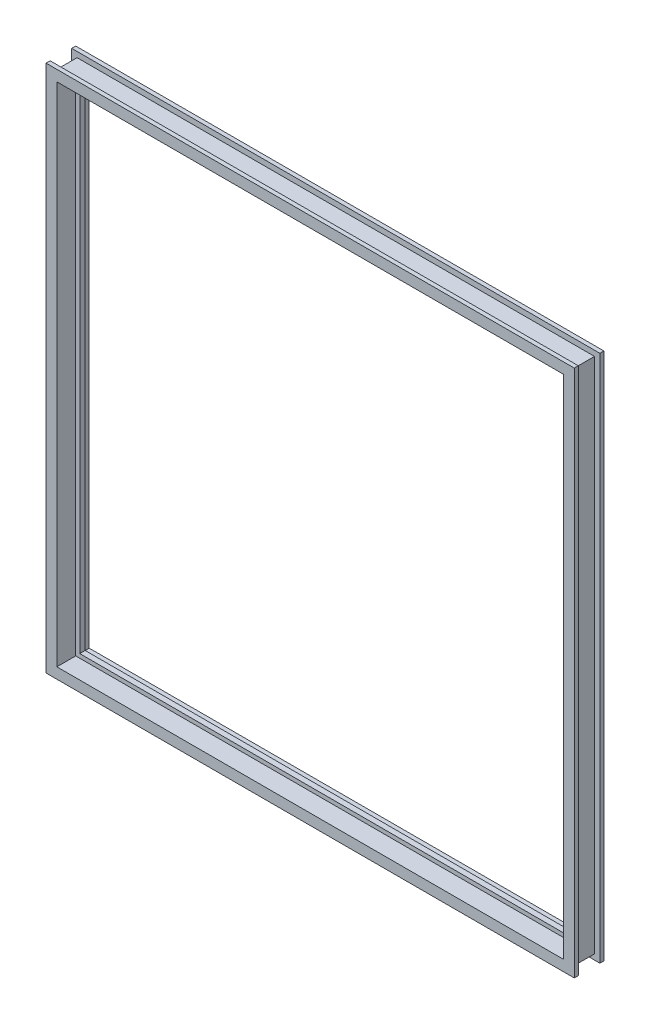
ISO-10303-21;
HEADER;
FILE_DESCRIPTION(('STEP AP214'),'2;1');
FILE_NAME('part.step','',(''),(''),'','','');
FILE_SCHEMA(('AUTOMOTIVE_DESIGN { 1 0 10303 214 1 1 1 1 }'));
ENDSEC;
DATA;
#1=APPLICATION_CONTEXT('core data for automotive mechanical design processes');
#2=APPLICATION_PROTOCOL_DEFINITION('international standard','automotive_design',2000,#1);
#3=PRODUCT_CONTEXT('',#1,'mechanical');
#4=PRODUCT('Part','Part','',(#3));
#5=PRODUCT_RELATED_PRODUCT_CATEGORY('part','',(#4));
#6=PRODUCT_DEFINITION_FORMATION('','',#4);
#7=PRODUCT_DEFINITION_CONTEXT('part definition',#1,'design');
#8=PRODUCT_DEFINITION('design','',#6,#7);
#9=PRODUCT_DEFINITION_SHAPE('','',#8);
#10=(LENGTH_UNIT() NAMED_UNIT(*) SI_UNIT(.MILLI.,.METRE.));
#11=(NAMED_UNIT(*) PLANE_ANGLE_UNIT() SI_UNIT($,.RADIAN.));
#12=(NAMED_UNIT(*) SI_UNIT($,.STERADIAN.) SOLID_ANGLE_UNIT());
#13=UNCERTAINTY_MEASURE_WITH_UNIT(LENGTH_MEASURE(1.E-05),#10,'distance_accuracy_value','');
#14=(GEOMETRIC_REPRESENTATION_CONTEXT(3) GLOBAL_UNCERTAINTY_ASSIGNED_CONTEXT((#13)) GLOBAL_UNIT_ASSIGNED_CONTEXT((#10,
#11,#12)) REPRESENTATION_CONTEXT('',''));
#15=CARTESIAN_POINT('',(0.,0.,0.));
#16=DIRECTION('',(0.,0.,1.));
#17=DIRECTION('',(1.,0.,0.));
#18=AXIS2_PLACEMENT_3D('',#15,#16,#17);
#19=CARTESIAN_POINT('',(304.8,616.685,-12.7));
#20=DIRECTION('',(-1.,0.,0.));
#21=DIRECTION('',(0.,-1.,0.));
#22=AXIS2_PLACEMENT_3D('',#19,#20,#21);
#23=PLANE('',#22);
#24=DIRECTION('',(0.,-1.,0.));
#25=VECTOR('',#24,1.);
#26=CARTESIAN_POINT('',(304.8,616.685,-12.7));
#27=LINE('',#26,#25);
#28=CARTESIAN_POINT('',(304.8,609.6,-12.7));
#29=VERTEX_POINT('',#28);
#30=CARTESIAN_POINT('',(304.8,0.,-12.7));
#31=VERTEX_POINT('',#30);
#32=EDGE_CURVE('E39',#29,#31,#27,.T.);
#33=ORIENTED_EDGE('',*,*,#32,.F.);
#34=DIRECTION('',(0.,0.,1.));
#35=VECTOR('',#34,1.);
#36=CARTESIAN_POINT('',(304.8,609.6,-12.7000000000002));
#37=LINE('',#36,#35);
#38=CARTESIAN_POINT('',(304.8,609.6,12.7));
#39=VERTEX_POINT('',#38);
#40=EDGE_CURVE('E326',#29,#39,#37,.T.);
#41=ORIENTED_EDGE('',*,*,#40,.T.);
#42=DIRECTION('',(0.,-1.,0.));
#43=VECTOR('',#42,1.);
#44=CARTESIAN_POINT('',(304.8,616.685,12.7));
#45=LINE('',#44,#43);
#46=CARTESIAN_POINT('',(304.8,0.,12.7));
#47=VERTEX_POINT('',#46);
#48=EDGE_CURVE('E151',#39,#47,#45,.T.);
#49=ORIENTED_EDGE('',*,*,#48,.T.);
#50=DIRECTION('',(0.,0.,1.));
#51=VECTOR('',#50,1.);
#52=CARTESIAN_POINT('',(304.8,0.,-12.7));
#53=LINE('',#52,#51);
#54=EDGE_CURVE('E148',#31,#47,#53,.T.);
#55=ORIENTED_EDGE('',*,*,#54,.F.);
#56=EDGE_LOOP('',(#33,#41,#49,#55));
#57=FACE_BOUND('',#56,.T.);
#58=ADVANCED_FACE('F36',(#57),#23,.F.);
#59=CARTESIAN_POINT('',(311.15,616.685,12.7));
#60=DIRECTION('',(-1.,0.,0.));
#61=DIRECTION('',(0.,-1.,0.));
#62=AXIS2_PLACEMENT_3D('',#59,#60,#61);
#63=PLANE('',#62);
#64=DIRECTION('',(0.,-1.,0.));
#65=VECTOR('',#64,1.);
#66=CARTESIAN_POINT('',(311.15,616.685,12.7));
#67=LINE('',#66,#65);
#68=CARTESIAN_POINT('',(311.15,615.95,12.7));
#69=VERTEX_POINT('',#68);
#70=CARTESIAN_POINT('',(311.15,-6.34999999999997,12.7));
#71=VERTEX_POINT('',#70);
#72=EDGE_CURVE('E173',#69,#71,#67,.T.);
#73=ORIENTED_EDGE('',*,*,#72,.F.);
#74=DIRECTION('',(0.,0.,1.));
#75=VECTOR('',#74,1.);
#76=CARTESIAN_POINT('',(311.15,615.95,12.7));
#77=LINE('',#76,#75);
#78=CARTESIAN_POINT('',(311.15,615.95,17.4625));
#79=VERTEX_POINT('',#78);
#80=EDGE_CURVE('E323',#69,#79,#77,.T.);
#81=ORIENTED_EDGE('',*,*,#80,.T.);
#82=DIRECTION('',(0.,-1.,0.));
#83=VECTOR('',#82,1.);
#84=CARTESIAN_POINT('',(311.15,616.685,17.4625));
#85=LINE('',#84,#83);
#86=CARTESIAN_POINT('',(311.15,-6.34999999999994,17.4625));
#87=VERTEX_POINT('',#86);
#88=EDGE_CURVE('E175',#79,#87,#85,.T.);
#89=ORIENTED_EDGE('',*,*,#88,.T.);
#90=DIRECTION('',(0.,0.,1.));
#91=VECTOR('',#90,1.);
#92=CARTESIAN_POINT('',(311.15,-6.34999999999996,12.7));
#93=LINE('',#92,#91);
#94=EDGE_CURVE('E155',#71,#87,#93,.T.);
#95=ORIENTED_EDGE('',*,*,#94,.F.);
#96=EDGE_LOOP('',(#73,#81,#89,#95));
#97=FACE_BOUND('',#96,.T.);
#98=ADVANCED_FACE('F452',(#97),#63,.F.);
#99=CARTESIAN_POINT('',(298.45,616.685,17.4625));
#100=DIRECTION('',(1.,0.,0.));
#101=DIRECTION('',(0.,1.,0.));
#102=AXIS2_PLACEMENT_3D('',#99,#100,#101);
#103=PLANE('',#102);
#104=DIRECTION('',(0.,-1.,0.));
#105=VECTOR('',#104,1.);
#106=CARTESIAN_POINT('',(298.45,616.685,17.4625));
#107=LINE('',#106,#105);
#108=CARTESIAN_POINT('',(298.45,603.25,17.4625));
#109=VERTEX_POINT('',#108);
#110=CARTESIAN_POINT('',(298.45,6.35000000000006,17.4625));
#111=VERTEX_POINT('',#110);
#112=EDGE_CURVE('E178',#109,#111,#107,.T.);
#113=ORIENTED_EDGE('',*,*,#112,.F.);
#114=DIRECTION('',(0.,0.,-1.));
#115=VECTOR('',#114,1.);
#116=CARTESIAN_POINT('',(298.45,603.25,17.4625));
#117=LINE('',#116,#115);
#118=CARTESIAN_POINT('',(298.45,603.25,-4.7625));
#119=VERTEX_POINT('',#118);
#120=EDGE_CURVE('E320',#109,#119,#117,.T.);
#121=ORIENTED_EDGE('',*,*,#120,.T.);
#122=DIRECTION('',(0.,-1.,0.));
#123=VECTOR('',#122,1.);
#124=CARTESIAN_POINT('',(298.45,616.685,-4.7625));
#125=LINE('',#124,#123);
#126=CARTESIAN_POINT('',(298.45,6.35000000000009,-4.7625));
#127=VERTEX_POINT('',#126);
#128=EDGE_CURVE('E180',#119,#127,#125,.T.);
#129=ORIENTED_EDGE('',*,*,#128,.T.);
#130=DIRECTION('',(0.,0.,-1.));
#131=VECTOR('',#130,1.);
#132=CARTESIAN_POINT('',(298.45,6.35000000000003,17.4625));
#133=LINE('',#132,#131);
#134=EDGE_CURVE('E361',#111,#127,#133,.T.);
#135=ORIENTED_EDGE('',*,*,#134,.F.);
#136=EDGE_LOOP('',(#113,#121,#129,#135));
#137=FACE_BOUND('',#136,.T.);
#138=ADVANCED_FACE('F504',(#137),#103,.F.);
#139=CARTESIAN_POINT('',(293.6875,616.685,-4.7625));
#140=DIRECTION('',(1.,0.,0.));
#141=DIRECTION('',(0.,1.,0.));
#142=AXIS2_PLACEMENT_3D('',#139,#140,#141);
#143=PLANE('',#142);
#144=DIRECTION('',(0.,-1.,0.));
#145=VECTOR('',#144,1.);
#146=CARTESIAN_POINT('',(293.6875,616.685,-4.7625));
#147=LINE('',#146,#145);
#148=CARTESIAN_POINT('',(293.6875,598.4875,-4.7625));
#149=VERTEX_POINT('',#148);
#150=CARTESIAN_POINT('',(293.6875,11.1125000000001,-4.7625));
#151=VERTEX_POINT('',#150);
#152=EDGE_CURVE('E183',#149,#151,#147,.T.);
#153=ORIENTED_EDGE('',*,*,#152,.F.);
#154=DIRECTION('',(0.,0.,-1.));
#155=VECTOR('',#154,1.);
#156=CARTESIAN_POINT('',(293.6875,598.4875,-4.7625));
#157=LINE('',#156,#155);
#158=CARTESIAN_POINT('',(293.6875,598.4875,-11.1125));
#159=VERTEX_POINT('',#158);
#160=EDGE_CURVE('E317',#149,#159,#157,.T.);
#161=ORIENTED_EDGE('',*,*,#160,.T.);
#162=DIRECTION('',(0.,-1.,0.));
#163=VECTOR('',#162,1.);
#164=CARTESIAN_POINT('',(293.6875,616.685,-11.1125));
#165=LINE('',#164,#163);
#166=CARTESIAN_POINT('',(293.6875,11.1125000000001,-11.1125));
#167=VERTEX_POINT('',#166);
#168=EDGE_CURVE('E185',#159,#167,#165,.T.);
#169=ORIENTED_EDGE('',*,*,#168,.T.);
#170=DIRECTION('',(0.,0.,-1.));
#171=VECTOR('',#170,1.);
#172=CARTESIAN_POINT('',(293.6875,11.1125,-4.7625));
#173=LINE('',#172,#171);
#174=EDGE_CURVE('E359',#151,#167,#173,.T.);
#175=ORIENTED_EDGE('',*,*,#174,.F.);
#176=EDGE_LOOP('',(#153,#161,#169,#175));
#177=FACE_BOUND('',#176,.T.);
#178=ADVANCED_FACE('F500',(#177),#143,.F.);
#179=CARTESIAN_POINT('',(295.275,616.685,-11.1125));
#180=DIRECTION('',(1.,0.,0.));
#181=DIRECTION('',(0.,1.,0.));
#182=AXIS2_PLACEMENT_3D('',#179,#180,#181);
#183=PLANE('',#182);
#184=DIRECTION('',(0.,-1.,0.));
#185=VECTOR('',#184,1.);
#186=CARTESIAN_POINT('',(295.275,616.685,-11.1125));
#187=LINE('',#186,#185);
#188=CARTESIAN_POINT('',(295.275,600.075,-11.1125));
#189=VERTEX_POINT('',#188);
#190=CARTESIAN_POINT('',(295.275,9.52500000000007,-11.1125));
#191=VERTEX_POINT('',#190);
#192=EDGE_CURVE('E188',#189,#191,#187,.T.);
#193=ORIENTED_EDGE('',*,*,#192,.F.);
#194=DIRECTION('',(0.,0.,-1.));
#195=VECTOR('',#194,1.);
#196=CARTESIAN_POINT('',(295.275,600.075,-11.1125));
#197=LINE('',#196,#195);
#198=CARTESIAN_POINT('',(295.275,600.075,-17.4625));
#199=VERTEX_POINT('',#198);
#200=EDGE_CURVE('E314',#189,#199,#197,.T.);
#201=ORIENTED_EDGE('',*,*,#200,.T.);
#202=DIRECTION('',(0.,-1.,0.));
#203=VECTOR('',#202,1.);
#204=CARTESIAN_POINT('',(295.275,616.685,-17.4625));
#205=LINE('',#204,#203);
#206=CARTESIAN_POINT('',(295.275,9.5250000000001,-17.4625));
#207=VERTEX_POINT('',#206);
#208=EDGE_CURVE('E190',#199,#207,#205,.T.);
#209=ORIENTED_EDGE('',*,*,#208,.T.);
#210=DIRECTION('',(0.,0.,-1.));
#211=VECTOR('',#210,1.);
#212=CARTESIAN_POINT('',(295.275,9.52500000000003,-11.1125));
#213=LINE('',#212,#211);
#214=EDGE_CURVE('E357',#191,#207,#213,.T.);
#215=ORIENTED_EDGE('',*,*,#214,.F.);
#216=EDGE_LOOP('',(#193,#201,#209,#215));
#217=FACE_BOUND('',#216,.T.);
#218=ADVANCED_FACE('F497',(#217),#183,.F.);
#219=CARTESIAN_POINT('',(311.15,616.685,-17.4625));
#220=DIRECTION('',(-1.,0.,0.));
#221=DIRECTION('',(0.,0.,1.));
#222=AXIS2_PLACEMENT_3D('',#219,#220,#221);
#223=PLANE('',#222);
#224=DIRECTION('',(0.,-1.,0.));
#225=VECTOR('',#224,1.);
#226=CARTESIAN_POINT('',(311.15,616.685,-17.4625));
#227=LINE('',#226,#225);
#228=CARTESIAN_POINT('',(311.15,615.95,-17.4625));
#229=VERTEX_POINT('',#228);
#230=CARTESIAN_POINT('',(311.15,-6.34999999999996,-17.4625));
#231=VERTEX_POINT('',#230);
#232=EDGE_CURVE('E132',#229,#231,#227,.T.);
#233=ORIENTED_EDGE('',*,*,#232,.F.);
#234=DIRECTION('',(0.,0.,1.));
#235=VECTOR('',#234,1.);
#236=CARTESIAN_POINT('',(311.15,615.95,-17.4624999999995));
#237=LINE('',#236,#235);
#238=CARTESIAN_POINT('',(311.15,615.95,-12.7));
#239=VERTEX_POINT('',#238);
#240=EDGE_CURVE('E200',#229,#239,#237,.T.);
#241=ORIENTED_EDGE('',*,*,#240,.T.);
#242=DIRECTION('',(0.,-1.,0.));
#243=VECTOR('',#242,1.);
#244=CARTESIAN_POINT('',(311.15,616.685,-12.7));
#245=LINE('',#244,#243);
#246=CARTESIAN_POINT('',(311.15,-6.34999999999993,-12.7));
#247=VERTEX_POINT('',#246);
#248=EDGE_CURVE('E149',#239,#247,#245,.T.);
#249=ORIENTED_EDGE('',*,*,#248,.T.);
#250=DIRECTION('',(0.,0.,1.));
#251=VECTOR('',#250,1.);
#252=CARTESIAN_POINT('',(311.15,-6.34999999999996,-17.4625));
#253=LINE('',#252,#251);
#254=EDGE_CURVE('E198',#231,#247,#253,.T.);
#255=ORIENTED_EDGE('',*,*,#254,.F.);
#256=EDGE_LOOP('',(#233,#241,#249,#255));
#257=FACE_BOUND('',#256,.T.);
#258=ADVANCED_FACE('F197',(#257),#223,.F.);
#259=CARTESIAN_POINT('',(311.885,0.,-12.7));
#260=DIRECTION('',(0.,1.,0.));
#261=DIRECTION('',(0.,0.,1.));
#262=AXIS2_PLACEMENT_3D('',#259,#260,#261);
#263=PLANE('',#262);
#264=DIRECTION('',(-1.,0.,0.));
#265=VECTOR('',#264,1.);
#266=CARTESIAN_POINT('',(311.885,0.,-12.7));
#267=LINE('',#266,#265);
#268=CARTESIAN_POINT('',(-304.8,0.,-12.7));
#269=VERTEX_POINT('',#268);
#270=EDGE_CURVE('E142',#31,#269,#267,.T.);
#271=ORIENTED_EDGE('',*,*,#270,.F.);
#272=ORIENTED_EDGE('',*,*,#54,.T.);
#273=DIRECTION('',(-1.,0.,0.));
#274=VECTOR('',#273,1.);
#275=CARTESIAN_POINT('',(311.885,0.,12.7));
#276=LINE('',#275,#274);
#277=CARTESIAN_POINT('',(-304.8,0.,12.7));
#278=VERTEX_POINT('',#277);
#279=EDGE_CURVE('E356',#47,#278,#276,.T.);
#280=ORIENTED_EDGE('',*,*,#279,.T.);
#281=DIRECTION('',(0.,0.,1.));
#282=VECTOR('',#281,1.);
#283=CARTESIAN_POINT('',(-304.8,0.,-12.7));
#284=LINE('',#283,#282);
#285=EDGE_CURVE('E159',#269,#278,#284,.T.);
#286=ORIENTED_EDGE('',*,*,#285,.F.);
#287=EDGE_LOOP('',(#271,#272,#280,#286));
#288=FACE_BOUND('',#287,.T.);
#289=ADVANCED_FACE('F157',(#288),#263,.F.);
#290=CARTESIAN_POINT('',(311.885,-6.34999999999996,12.7));
#291=DIRECTION('',(0.,1.,0.));
#292=DIRECTION('',(-1.,0.,0.));
#293=AXIS2_PLACEMENT_3D('',#290,#291,#292);
#294=PLANE('',#293);
#295=DIRECTION('',(-1.,0.,0.));
#296=VECTOR('',#295,1.);
#297=CARTESIAN_POINT('',(311.885,-6.34999999999996,12.7));
#298=LINE('',#297,#296);
#299=CARTESIAN_POINT('',(-311.15,-6.35000000000004,12.7));
#300=VERTEX_POINT('',#299);
#301=EDGE_CURVE('E365',#71,#300,#298,.T.);
#302=ORIENTED_EDGE('',*,*,#301,.F.);
#303=ORIENTED_EDGE('',*,*,#94,.T.);
#304=DIRECTION('',(-1.,0.,0.));
#305=VECTOR('',#304,1.);
#306=CARTESIAN_POINT('',(311.885,-6.34999999999996,17.4625));
#307=LINE('',#306,#305);
#308=CARTESIAN_POINT('',(-311.15,-6.35000000000004,17.4625));
#309=VERTEX_POINT('',#308);
#310=EDGE_CURVE('E367',#87,#309,#307,.T.);
#311=ORIENTED_EDGE('',*,*,#310,.T.);
#312=DIRECTION('',(0.,0.,1.));
#313=VECTOR('',#312,1.);
#314=CARTESIAN_POINT('',(-311.15,-6.35000000000003,12.7));
#315=LINE('',#314,#313);
#316=EDGE_CURVE('E391',#300,#309,#315,.T.);
#317=ORIENTED_EDGE('',*,*,#316,.F.);
#318=EDGE_LOOP('',(#302,#303,#311,#317));
#319=FACE_BOUND('',#318,.T.);
#320=ADVANCED_FACE('F455',(#319),#294,.F.);
#321=CARTESIAN_POINT('',(311.885,6.35000000000003,17.4625));
#322=DIRECTION('',(0.,-1.,0.));
#323=DIRECTION('',(1.,0.,0.));
#324=AXIS2_PLACEMENT_3D('',#321,#322,#323);
#325=PLANE('',#324);
#326=DIRECTION('',(-1.,0.,0.));
#327=VECTOR('',#326,1.);
#328=CARTESIAN_POINT('',(311.885,6.35000000000003,17.4625));
#329=LINE('',#328,#327);
#330=CARTESIAN_POINT('',(-298.45,6.34999999999999,17.4625));
#331=VERTEX_POINT('',#330);
#332=EDGE_CURVE('E370',#111,#331,#329,.T.);
#333=ORIENTED_EDGE('',*,*,#332,.F.);
#334=ORIENTED_EDGE('',*,*,#134,.T.);
#335=DIRECTION('',(-1.,0.,0.));
#336=VECTOR('',#335,1.);
#337=CARTESIAN_POINT('',(311.885,6.35000000000004,-4.7625));
#338=LINE('',#337,#336);
#339=CARTESIAN_POINT('',(-298.45,6.34999999999998,-4.7625));
#340=VERTEX_POINT('',#339);
#341=EDGE_CURVE('E372',#127,#340,#338,.T.);
#342=ORIENTED_EDGE('',*,*,#341,.T.);
#343=DIRECTION('',(0.,0.,-1.));
#344=VECTOR('',#343,1.);
#345=CARTESIAN_POINT('',(-298.45,6.35000000000002,17.4625));
#346=LINE('',#345,#344);
#347=EDGE_CURVE('E458',#331,#340,#346,.T.);
#348=ORIENTED_EDGE('',*,*,#347,.F.);
#349=EDGE_LOOP('',(#333,#334,#342,#348));
#350=FACE_BOUND('',#349,.T.);
#351=ADVANCED_FACE('F486',(#350),#325,.F.);
#352=CARTESIAN_POINT('',(311.885,11.1125,-4.7625));
#353=DIRECTION('',(0.,-1.,0.));
#354=DIRECTION('',(1.,0.,0.));
#355=AXIS2_PLACEMENT_3D('',#352,#353,#354);
#356=PLANE('',#355);
#357=DIRECTION('',(-1.,0.,0.));
#358=VECTOR('',#357,1.);
#359=CARTESIAN_POINT('',(311.885,11.1125,-4.7625));
#360=LINE('',#359,#358);
#361=CARTESIAN_POINT('',(-293.6875,11.1125,-4.7625));
#362=VERTEX_POINT('',#361);
#363=EDGE_CURVE('E375',#151,#362,#360,.T.);
#364=ORIENTED_EDGE('',*,*,#363,.F.);
#365=ORIENTED_EDGE('',*,*,#174,.T.);
#366=DIRECTION('',(-1.,0.,0.));
#367=VECTOR('',#366,1.);
#368=CARTESIAN_POINT('',(311.885,11.1125,-11.1125));
#369=LINE('',#368,#367);
#370=CARTESIAN_POINT('',(-293.6875,11.1125,-11.1125));
#371=VERTEX_POINT('',#370);
#372=EDGE_CURVE('E377',#167,#371,#369,.T.);
#373=ORIENTED_EDGE('',*,*,#372,.T.);
#374=DIRECTION('',(0.,0.,-1.));
#375=VECTOR('',#374,1.);
#376=CARTESIAN_POINT('',(-293.6875,11.1125,-4.7625));
#377=LINE('',#376,#375);
#378=EDGE_CURVE('E746',#362,#371,#377,.T.);
#379=ORIENTED_EDGE('',*,*,#378,.F.);
#380=EDGE_LOOP('',(#364,#365,#373,#379));
#381=FACE_BOUND('',#380,.T.);
#382=ADVANCED_FACE('F482',(#381),#356,.F.);
#383=CARTESIAN_POINT('',(311.885,9.52500000000003,-11.1125));
#384=DIRECTION('',(0.,-1.,0.));
#385=DIRECTION('',(1.,0.,0.));
#386=AXIS2_PLACEMENT_3D('',#383,#384,#385);
#387=PLANE('',#386);
#388=DIRECTION('',(-1.,0.,0.));
#389=VECTOR('',#388,1.);
#390=CARTESIAN_POINT('',(311.885,9.52500000000003,-11.1125));
#391=LINE('',#390,#389);
#392=CARTESIAN_POINT('',(-295.275,9.52499999999996,-11.1125));
#393=VERTEX_POINT('',#392);
#394=EDGE_CURVE('E380',#191,#393,#391,.T.);
#395=ORIENTED_EDGE('',*,*,#394,.F.);
#396=ORIENTED_EDGE('',*,*,#214,.T.);
#397=DIRECTION('',(-1.,0.,0.));
#398=VECTOR('',#397,1.);
#399=CARTESIAN_POINT('',(311.885,9.52500000000003,-17.4625));
#400=LINE('',#399,#398);
#401=CARTESIAN_POINT('',(-295.275,9.52499999999997,-17.4625));
#402=VERTEX_POINT('',#401);
#403=EDGE_CURVE('E382',#207,#402,#400,.T.);
#404=ORIENTED_EDGE('',*,*,#403,.T.);
#405=DIRECTION('',(0.,0.,-1.));
#406=VECTOR('',#405,1.);
#407=CARTESIAN_POINT('',(-295.275,9.525,-11.1125));
#408=LINE('',#407,#406);
#409=EDGE_CURVE('E755',#393,#402,#408,.T.);
#410=ORIENTED_EDGE('',*,*,#409,.F.);
#411=EDGE_LOOP('',(#395,#396,#404,#410));
#412=FACE_BOUND('',#411,.T.);
#413=ADVANCED_FACE('F479',(#412),#387,.F.);
#414=CARTESIAN_POINT('',(311.885,-6.34999999999996,-17.4625));
#415=DIRECTION('',(0.,1.,0.));
#416=DIRECTION('',(0.,0.,1.));
#417=AXIS2_PLACEMENT_3D('',#414,#415,#416);
#418=PLANE('',#417);
#419=DIRECTION('',(-1.,0.,0.));
#420=VECTOR('',#419,1.);
#421=CARTESIAN_POINT('',(311.885,-6.34999999999996,-17.4625));
#422=LINE('',#421,#420);
#423=CARTESIAN_POINT('',(-311.15,-6.35000000000004,-17.4625));
#424=VERTEX_POINT('',#423);
#425=EDGE_CURVE('E168',#231,#424,#422,.T.);
#426=ORIENTED_EDGE('',*,*,#425,.F.);
#427=ORIENTED_EDGE('',*,*,#254,.T.);
#428=DIRECTION('',(-1.,0.,0.));
#429=VECTOR('',#428,1.);
#430=CARTESIAN_POINT('',(311.885,-6.34999999999996,-12.7));
#431=LINE('',#430,#429);
#432=CARTESIAN_POINT('',(-311.15,-6.35000000000004,-12.7));
#433=VERTEX_POINT('',#432);
#434=EDGE_CURVE('E162',#247,#433,#431,.T.);
#435=ORIENTED_EDGE('',*,*,#434,.T.);
#436=DIRECTION('',(0.,0.,1.));
#437=VECTOR('',#436,1.);
#438=CARTESIAN_POINT('',(-311.15,-6.35000000000003,-17.4625));
#439=LINE('',#438,#437);
#440=EDGE_CURVE('E208',#424,#433,#439,.T.);
#441=ORIENTED_EDGE('',*,*,#440,.F.);
#442=EDGE_LOOP('',(#426,#427,#435,#441));
#443=FACE_BOUND('',#442,.T.);
#444=ADVANCED_FACE('F205',(#443),#418,.F.);
#445=CARTESIAN_POINT('',(-311.885,609.6,-12.7));
#446=DIRECTION('',(0.,-1.,0.));
#447=DIRECTION('',(0.,0.,-1.));
#448=AXIS2_PLACEMENT_3D('',#445,#446,#447);
#449=PLANE('',#448);
#450=DIRECTION('',(1.,0.,0.));
#451=VECTOR('',#450,1.);
#452=CARTESIAN_POINT('',(-311.885,609.6,-12.7));
#453=LINE('',#452,#451);
#454=CARTESIAN_POINT('',(-304.8,609.6,-12.7));
#455=VERTEX_POINT('',#454);
#456=EDGE_CURVE('E145',#455,#29,#453,.T.);
#457=ORIENTED_EDGE('',*,*,#456,.F.);
#458=DIRECTION('',(0.,0.,1.));
#459=VECTOR('',#458,1.);
#460=CARTESIAN_POINT('',(-304.8,609.6,-12.7000000000002));
#461=LINE('',#460,#459);
#462=CARTESIAN_POINT('',(-304.8,609.6,12.7));
#463=VERTEX_POINT('',#462);
#464=EDGE_CURVE('E275',#455,#463,#461,.T.);
#465=ORIENTED_EDGE('',*,*,#464,.T.);
#466=DIRECTION('',(1.,0.,0.));
#467=VECTOR('',#466,1.);
#468=CARTESIAN_POINT('',(-311.885,609.6,12.7));
#469=LINE('',#468,#467);
#470=EDGE_CURVE('E161',#463,#39,#469,.T.);
#471=ORIENTED_EDGE('',*,*,#470,.T.);
#472=ORIENTED_EDGE('',*,*,#40,.F.);
#473=EDGE_LOOP('',(#457,#465,#471,#472));
#474=FACE_BOUND('',#473,.T.);
#475=ADVANCED_FACE('F276',(#474),#449,.F.);
#476=CARTESIAN_POINT('',(-311.885,615.95,12.7));
#477=DIRECTION('',(0.,-1.,0.));
#478=DIRECTION('',(0.,0.,-1.));
#479=AXIS2_PLACEMENT_3D('',#476,#477,#478);
#480=PLANE('',#479);
#481=DIRECTION('',(1.,0.,0.));
#482=VECTOR('',#481,1.);
#483=CARTESIAN_POINT('',(-311.885,615.95,12.7));
#484=LINE('',#483,#482);
#485=CARTESIAN_POINT('',(-311.15,615.95,12.7));
#486=VERTEX_POINT('',#485);
#487=EDGE_CURVE('E165',#486,#69,#484,.T.);
#488=ORIENTED_EDGE('',*,*,#487,.F.);
#489=DIRECTION('',(0.,0.,1.));
#490=VECTOR('',#489,1.);
#491=CARTESIAN_POINT('',(-311.15,615.95,12.7));
#492=LINE('',#491,#490);
#493=CARTESIAN_POINT('',(-311.15,615.95,17.4625));
#494=VERTEX_POINT('',#493);
#495=EDGE_CURVE('E278',#486,#494,#492,.T.);
#496=ORIENTED_EDGE('',*,*,#495,.T.);
#497=DIRECTION('',(1.,0.,0.));
#498=VECTOR('',#497,1.);
#499=CARTESIAN_POINT('',(-311.885,615.95,17.4625));
#500=LINE('',#499,#498);
#501=EDGE_CURVE('E330',#494,#79,#500,.T.);
#502=ORIENTED_EDGE('',*,*,#501,.T.);
#503=ORIENTED_EDGE('',*,*,#80,.F.);
#504=EDGE_LOOP('',(#488,#496,#502,#503));
#505=FACE_BOUND('',#504,.T.);
#506=ADVANCED_FACE('F463',(#505),#480,.F.);
#507=CARTESIAN_POINT('',(-311.885,603.25,17.4625));
#508=DIRECTION('',(0.,1.,0.));
#509=DIRECTION('',(0.,0.,1.));
#510=AXIS2_PLACEMENT_3D('',#507,#508,#509);
#511=PLANE('',#510);
#512=DIRECTION('',(1.,0.,0.));
#513=VECTOR('',#512,1.);
#514=CARTESIAN_POINT('',(-311.885,603.25,17.4625));
#515=LINE('',#514,#513);
#516=CARTESIAN_POINT('',(-298.45,603.25,17.4625));
#517=VERTEX_POINT('',#516);
#518=EDGE_CURVE('E333',#517,#109,#515,.T.);
#519=ORIENTED_EDGE('',*,*,#518,.F.);
#520=DIRECTION('',(0.,0.,-1.));
#521=VECTOR('',#520,1.);
#522=CARTESIAN_POINT('',(-298.45,603.25,17.4625));
#523=LINE('',#522,#521);
#524=CARTESIAN_POINT('',(-298.45,603.25,-4.7625));
#525=VERTEX_POINT('',#524);
#526=EDGE_CURVE('E461',#517,#525,#523,.T.);
#527=ORIENTED_EDGE('',*,*,#526,.T.);
#528=DIRECTION('',(1.,0.,0.));
#529=VECTOR('',#528,1.);
#530=CARTESIAN_POINT('',(-311.885,603.25,-4.7625));
#531=LINE('',#530,#529);
#532=EDGE_CURVE('E336',#525,#119,#531,.T.);
#533=ORIENTED_EDGE('',*,*,#532,.T.);
#534=ORIENTED_EDGE('',*,*,#120,.F.);
#535=EDGE_LOOP('',(#519,#527,#533,#534));
#536=FACE_BOUND('',#535,.T.);
#537=ADVANCED_FACE('F466',(#536),#511,.F.);
#538=CARTESIAN_POINT('',(-311.885,598.4875,-4.7625));
#539=DIRECTION('',(0.,1.,0.));
#540=DIRECTION('',(0.,0.,1.));
#541=AXIS2_PLACEMENT_3D('',#538,#539,#540);
#542=PLANE('',#541);
#543=DIRECTION('',(1.,0.,0.));
#544=VECTOR('',#543,1.);
#545=CARTESIAN_POINT('',(-311.885,598.4875,-4.7625));
#546=LINE('',#545,#544);
#547=CARTESIAN_POINT('',(-293.6875,598.4875,-4.7625));
#548=VERTEX_POINT('',#547);
#549=EDGE_CURVE('E339',#548,#149,#546,.T.);
#550=ORIENTED_EDGE('',*,*,#549,.F.);
#551=DIRECTION('',(0.,0.,-1.));
#552=VECTOR('',#551,1.);
#553=CARTESIAN_POINT('',(-293.6875,598.4875,-4.7625));
#554=LINE('',#553,#552);
#555=CARTESIAN_POINT('',(-293.6875,598.4875,-11.1125));
#556=VERTEX_POINT('',#555);
#557=EDGE_CURVE('E740',#548,#556,#554,.T.);
#558=ORIENTED_EDGE('',*,*,#557,.T.);
#559=DIRECTION('',(1.,0.,0.));
#560=VECTOR('',#559,1.);
#561=CARTESIAN_POINT('',(-311.885,598.4875,-11.1125));
#562=LINE('',#561,#560);
#563=EDGE_CURVE('E342',#556,#159,#562,.T.);
#564=ORIENTED_EDGE('',*,*,#563,.T.);
#565=ORIENTED_EDGE('',*,*,#160,.F.);
#566=EDGE_LOOP('',(#550,#558,#564,#565));
#567=FACE_BOUND('',#566,.T.);
#568=ADVANCED_FACE('F402',(#567),#542,.F.);
#569=CARTESIAN_POINT('',(-311.885,600.075,-11.1125));
#570=DIRECTION('',(0.,1.,0.));
#571=DIRECTION('',(0.,0.,1.));
#572=AXIS2_PLACEMENT_3D('',#569,#570,#571);
#573=PLANE('',#572);
#574=DIRECTION('',(1.,0.,0.));
#575=VECTOR('',#574,1.);
#576=CARTESIAN_POINT('',(-311.885,600.075,-11.1125));
#577=LINE('',#576,#575);
#578=CARTESIAN_POINT('',(-295.275,600.075,-11.1125));
#579=VERTEX_POINT('',#578);
#580=EDGE_CURVE('E345',#579,#189,#577,.T.);
#581=ORIENTED_EDGE('',*,*,#580,.F.);
#582=DIRECTION('',(0.,0.,-1.));
#583=VECTOR('',#582,1.);
#584=CARTESIAN_POINT('',(-295.275,600.075,-11.1125));
#585=LINE('',#584,#583);
#586=CARTESIAN_POINT('',(-295.275,600.075,-17.4625));
#587=VERTEX_POINT('',#586);
#588=EDGE_CURVE('E390',#579,#587,#585,.T.);
#589=ORIENTED_EDGE('',*,*,#588,.T.);
#590=DIRECTION('',(1.,0.,0.));
#591=VECTOR('',#590,1.);
#592=CARTESIAN_POINT('',(-311.885,600.075,-17.4625));
#593=LINE('',#592,#591);
#594=EDGE_CURVE('E348',#587,#199,#593,.T.);
#595=ORIENTED_EDGE('',*,*,#594,.T.);
#596=ORIENTED_EDGE('',*,*,#200,.F.);
#597=EDGE_LOOP('',(#581,#589,#595,#596));
#598=FACE_BOUND('',#597,.T.);
#599=ADVANCED_FACE('F395',(#598),#573,.F.);
#600=CARTESIAN_POINT('',(-311.885,615.95,-17.4625));
#601=DIRECTION('',(0.,-1.,0.));
#602=DIRECTION('',(0.,0.,-1.));
#603=AXIS2_PLACEMENT_3D('',#600,#601,#602);
#604=PLANE('',#603);
#605=DIRECTION('',(1.,0.,0.));
#606=VECTOR('',#605,1.);
#607=CARTESIAN_POINT('',(-311.885,615.95,-17.4625));
#608=LINE('',#607,#606);
#609=CARTESIAN_POINT('',(-311.15,615.95,-17.4625));
#610=VERTEX_POINT('',#609);
#611=EDGE_CURVE('E351',#610,#229,#608,.T.);
#612=ORIENTED_EDGE('',*,*,#611,.F.);
#613=DIRECTION('',(0.,0.,1.));
#614=VECTOR('',#613,1.);
#615=CARTESIAN_POINT('',(-311.15,615.95,-17.4624999999995));
#616=LINE('',#615,#614);
#617=CARTESIAN_POINT('',(-311.15,615.95,-12.7));
#618=VERTEX_POINT('',#617);
#619=EDGE_CURVE('E388',#610,#618,#616,.T.);
#620=ORIENTED_EDGE('',*,*,#619,.T.);
#621=DIRECTION('',(1.,0.,0.));
#622=VECTOR('',#621,1.);
#623=CARTESIAN_POINT('',(-311.885,615.95,-12.7));
#624=LINE('',#623,#622);
#625=EDGE_CURVE('E54',#618,#239,#624,.T.);
#626=ORIENTED_EDGE('',*,*,#625,.T.);
#627=ORIENTED_EDGE('',*,*,#240,.F.);
#628=EDGE_LOOP('',(#612,#620,#626,#627));
#629=FACE_BOUND('',#628,.T.);
#630=ADVANCED_FACE('F393',(#629),#604,.F.);
#631=CARTESIAN_POINT('',(-304.8,-7.08500000000016,-12.7));
#632=DIRECTION('',(1.,0.,0.));
#633=DIRECTION('',(0.,0.,-1.));
#634=AXIS2_PLACEMENT_3D('',#631,#632,#633);
#635=PLANE('',#634);
#636=ORIENTED_EDGE('',*,*,#285,.T.);
#637=DIRECTION('',(0.,1.,0.));
#638=VECTOR('',#637,1.);
#639=CARTESIAN_POINT('',(-304.8,-7.08500000000016,12.7));
#640=LINE('',#639,#638);
#641=EDGE_CURVE('E273',#278,#463,#640,.T.);
#642=ORIENTED_EDGE('',*,*,#641,.T.);
#643=ORIENTED_EDGE('',*,*,#464,.F.);
#644=DIRECTION('',(0.,1.,0.));
#645=VECTOR('',#644,1.);
#646=CARTESIAN_POINT('',(-304.8,-7.08500000000016,-12.7));
#647=LINE('',#646,#645);
#648=EDGE_CURVE('E11',#269,#455,#647,.T.);
#649=ORIENTED_EDGE('',*,*,#648,.F.);
#650=EDGE_LOOP('',(#636,#642,#643,#649));
#651=FACE_BOUND('',#650,.T.);
#652=ADVANCED_FACE('F280',(#651),#635,.F.);
#653=CARTESIAN_POINT('',(-304.8,-7.08500000000016,12.7));
#654=DIRECTION('',(0.,0.,1.));
#655=DIRECTION('',(1.,0.,0.));
#656=AXIS2_PLACEMENT_3D('',#653,#654,#655);
#657=PLANE('',#656);
#658=ORIENTED_EDGE('',*,*,#72,.T.);
#659=ORIENTED_EDGE('',*,*,#301,.T.);
#660=DIRECTION('',(0.,1.,0.));
#661=VECTOR('',#660,1.);
#662=CARTESIAN_POINT('',(-311.15,-7.08500000000016,12.7));
#663=LINE('',#662,#661);
#664=EDGE_CURVE('E281',#300,#486,#663,.T.);
#665=ORIENTED_EDGE('',*,*,#664,.T.);
#666=ORIENTED_EDGE('',*,*,#487,.T.);
#667=EDGE_LOOP('',(#658,#659,#665,#666));
#668=FACE_BOUND('',#667,.T.);
#669=ORIENTED_EDGE('',*,*,#641,.F.);
#670=ORIENTED_EDGE('',*,*,#279,.F.);
#671=ORIENTED_EDGE('',*,*,#48,.F.);
#672=ORIENTED_EDGE('',*,*,#470,.F.);
#673=EDGE_LOOP('',(#669,#670,#671,#672));
#674=FACE_BOUND('',#673,.T.);
#675=ADVANCED_FACE('F271',(#668,#674),#657,.F.);
#676=CARTESIAN_POINT('',(-311.15,-7.08500000000016,12.7));
#677=DIRECTION('',(1.,0.,0.));
#678=DIRECTION('',(0.,1.,0.));
#679=AXIS2_PLACEMENT_3D('',#676,#677,#678);
#680=PLANE('',#679);
#681=ORIENTED_EDGE('',*,*,#316,.T.);
#682=DIRECTION('',(0.,1.,0.));
#683=VECTOR('',#682,1.);
#684=CARTESIAN_POINT('',(-311.15,-7.08500000000016,17.4625));
#685=LINE('',#684,#683);
#686=EDGE_CURVE('E284',#309,#494,#685,.T.);
#687=ORIENTED_EDGE('',*,*,#686,.T.);
#688=ORIENTED_EDGE('',*,*,#495,.F.);
#689=ORIENTED_EDGE('',*,*,#664,.F.);
#690=EDGE_LOOP('',(#681,#687,#688,#689));
#691=FACE_BOUND('',#690,.T.);
#692=ADVANCED_FACE('F437',(#691),#680,.F.);
#693=CARTESIAN_POINT('',(-311.15,-7.08500000000016,17.4625));
#694=DIRECTION('',(0.,0.,-1.));
#695=DIRECTION('',(-1.,0.,0.));
#696=AXIS2_PLACEMENT_3D('',#693,#694,#695);
#697=PLANE('',#696);
#698=ORIENTED_EDGE('',*,*,#112,.T.);
#699=ORIENTED_EDGE('',*,*,#332,.T.);
#700=DIRECTION('',(0.,1.,0.));
#701=VECTOR('',#700,1.);
#702=CARTESIAN_POINT('',(-298.45,-7.08500000000017,17.4625));
#703=LINE('',#702,#701);
#704=EDGE_CURVE('E291',#331,#517,#703,.T.);
#705=ORIENTED_EDGE('',*,*,#704,.T.);
#706=ORIENTED_EDGE('',*,*,#518,.T.);
#707=EDGE_LOOP('',(#698,#699,#705,#706));
#708=FACE_BOUND('',#707,.T.);
#709=ORIENTED_EDGE('',*,*,#686,.F.);
#710=ORIENTED_EDGE('',*,*,#310,.F.);
#711=ORIENTED_EDGE('',*,*,#88,.F.);
#712=ORIENTED_EDGE('',*,*,#501,.F.);
#713=EDGE_LOOP('',(#709,#710,#711,#712));
#714=FACE_BOUND('',#713,.T.);
#715=ADVANCED_FACE('F433',(#708,#714),#697,.F.);
#716=CARTESIAN_POINT('',(-298.45,-7.08500000000017,17.4625));
#717=DIRECTION('',(-1.,0.,0.));
#718=DIRECTION('',(0.,-1.,0.));
#719=AXIS2_PLACEMENT_3D('',#716,#717,#718);
#720=PLANE('',#719);
#721=ORIENTED_EDGE('',*,*,#347,.T.);
#722=DIRECTION('',(0.,1.,0.));
#723=VECTOR('',#722,1.);
#724=CARTESIAN_POINT('',(-298.45,-7.08500000000017,-4.7625));
#725=LINE('',#724,#723);
#726=EDGE_CURVE('E294',#340,#525,#725,.T.);
#727=ORIENTED_EDGE('',*,*,#726,.T.);
#728=ORIENTED_EDGE('',*,*,#526,.F.);
#729=ORIENTED_EDGE('',*,*,#704,.F.);
#730=EDGE_LOOP('',(#721,#727,#728,#729));
#731=FACE_BOUND('',#730,.T.);
#732=ADVANCED_FACE('F429',(#731),#720,.F.);
#733=CARTESIAN_POINT('',(-298.45,-7.08500000000017,-4.7625));
#734=DIRECTION('',(0.,0.,-1.));
#735=DIRECTION('',(-1.,0.,0.));
#736=AXIS2_PLACEMENT_3D('',#733,#734,#735);
#737=PLANE('',#736);
#738=ORIENTED_EDGE('',*,*,#152,.T.);
#739=ORIENTED_EDGE('',*,*,#363,.T.);
#740=DIRECTION('',(0.,1.,0.));
#741=VECTOR('',#740,1.);
#742=CARTESIAN_POINT('',(-293.6875,-7.08500000000017,-4.7625));
#743=LINE('',#742,#741);
#744=EDGE_CURVE('E297',#362,#548,#743,.T.);
#745=ORIENTED_EDGE('',*,*,#744,.T.);
#746=ORIENTED_EDGE('',*,*,#549,.T.);
#747=EDGE_LOOP('',(#738,#739,#745,#746));
#748=FACE_BOUND('',#747,.T.);
#749=ORIENTED_EDGE('',*,*,#726,.F.);
#750=ORIENTED_EDGE('',*,*,#341,.F.);
#751=ORIENTED_EDGE('',*,*,#128,.F.);
#752=ORIENTED_EDGE('',*,*,#532,.F.);
#753=EDGE_LOOP('',(#749,#750,#751,#752));
#754=FACE_BOUND('',#753,.T.);
#755=ADVANCED_FACE('F425',(#748,#754),#737,.F.);
#756=CARTESIAN_POINT('',(-293.6875,-7.08500000000017,-4.7625));
#757=DIRECTION('',(-1.,0.,0.));
#758=DIRECTION('',(0.,-1.,0.));
#759=AXIS2_PLACEMENT_3D('',#756,#757,#758);
#760=PLANE('',#759);
#761=ORIENTED_EDGE('',*,*,#378,.T.);
#762=DIRECTION('',(0.,1.,0.));
#763=VECTOR('',#762,1.);
#764=CARTESIAN_POINT('',(-293.6875,-7.08500000000017,-11.1125));
#765=LINE('',#764,#763);
#766=EDGE_CURVE('E300',#371,#556,#765,.T.);
#767=ORIENTED_EDGE('',*,*,#766,.T.);
#768=ORIENTED_EDGE('',*,*,#557,.F.);
#769=ORIENTED_EDGE('',*,*,#744,.F.);
#770=EDGE_LOOP('',(#761,#767,#768,#769));
#771=FACE_BOUND('',#770,.T.);
#772=ADVANCED_FACE('F421',(#771),#760,.F.);
#773=CARTESIAN_POINT('',(-293.6875,-7.08500000000017,-11.1125));
#774=DIRECTION('',(0.,0.,1.));
#775=DIRECTION('',(1.,0.,0.));
#776=AXIS2_PLACEMENT_3D('',#773,#774,#775);
#777=PLANE('',#776);
#778=ORIENTED_EDGE('',*,*,#192,.T.);
#779=ORIENTED_EDGE('',*,*,#394,.T.);
#780=DIRECTION('',(0.,1.,0.));
#781=VECTOR('',#780,1.);
#782=CARTESIAN_POINT('',(-295.275,-7.08500000000017,-11.1125));
#783=LINE('',#782,#781);
#784=EDGE_CURVE('E303',#393,#579,#783,.T.);
#785=ORIENTED_EDGE('',*,*,#784,.T.);
#786=ORIENTED_EDGE('',*,*,#580,.T.);
#787=EDGE_LOOP('',(#778,#779,#785,#786));
#788=FACE_BOUND('',#787,.T.);
#789=ORIENTED_EDGE('',*,*,#766,.F.);
#790=ORIENTED_EDGE('',*,*,#372,.F.);
#791=ORIENTED_EDGE('',*,*,#168,.F.);
#792=ORIENTED_EDGE('',*,*,#563,.F.);
#793=EDGE_LOOP('',(#789,#790,#791,#792));
#794=FACE_BOUND('',#793,.T.);
#795=ADVANCED_FACE('F417',(#788,#794),#777,.F.);
#796=CARTESIAN_POINT('',(-295.275,-7.08500000000017,-11.1125));
#797=DIRECTION('',(-1.,0.,0.));
#798=DIRECTION('',(0.,-1.,0.));
#799=AXIS2_PLACEMENT_3D('',#796,#797,#798);
#800=PLANE('',#799);
#801=ORIENTED_EDGE('',*,*,#409,.T.);
#802=DIRECTION('',(0.,1.,0.));
#803=VECTOR('',#802,1.);
#804=CARTESIAN_POINT('',(-295.275,-7.08500000000017,-17.4625));
#805=LINE('',#804,#803);
#806=EDGE_CURVE('E306',#402,#587,#805,.T.);
#807=ORIENTED_EDGE('',*,*,#806,.T.);
#808=ORIENTED_EDGE('',*,*,#588,.F.);
#809=ORIENTED_EDGE('',*,*,#784,.F.);
#810=EDGE_LOOP('',(#801,#807,#808,#809));
#811=FACE_BOUND('',#810,.T.);
#812=ADVANCED_FACE('F414',(#811),#800,.F.);
#813=CARTESIAN_POINT('',(-295.275,-7.08500000000017,-17.4625));
#814=DIRECTION('',(0.,0.,1.));
#815=DIRECTION('',(1.,0.,0.));
#816=AXIS2_PLACEMENT_3D('',#813,#814,#815);
#817=PLANE('',#816);
#818=ORIENTED_EDGE('',*,*,#232,.T.);
#819=ORIENTED_EDGE('',*,*,#425,.T.);
#820=DIRECTION('',(0.,1.,0.));
#821=VECTOR('',#820,1.);
#822=CARTESIAN_POINT('',(-311.15,-7.08500000000016,-17.4625));
#823=LINE('',#822,#821);
#824=EDGE_CURVE('E309',#424,#610,#823,.T.);
#825=ORIENTED_EDGE('',*,*,#824,.T.);
#826=ORIENTED_EDGE('',*,*,#611,.T.);
#827=EDGE_LOOP('',(#818,#819,#825,#826));
#828=FACE_BOUND('',#827,.T.);
#829=ORIENTED_EDGE('',*,*,#806,.F.);
#830=ORIENTED_EDGE('',*,*,#403,.F.);
#831=ORIENTED_EDGE('',*,*,#208,.F.);
#832=ORIENTED_EDGE('',*,*,#594,.F.);
#833=EDGE_LOOP('',(#829,#830,#831,#832));
#834=FACE_BOUND('',#833,.T.);
#835=ADVANCED_FACE('F384',(#828,#834),#817,.F.);
#836=CARTESIAN_POINT('',(-311.15,-7.08500000000016,-17.4625));
#837=DIRECTION('',(1.,0.,0.));
#838=DIRECTION('',(0.,0.,-1.));
#839=AXIS2_PLACEMENT_3D('',#836,#837,#838);
#840=PLANE('',#839);
#841=ORIENTED_EDGE('',*,*,#440,.T.);
#842=DIRECTION('',(0.,1.,0.));
#843=VECTOR('',#842,1.);
#844=CARTESIAN_POINT('',(-311.15,-7.08500000000016,-12.7));
#845=LINE('',#844,#843);
#846=EDGE_CURVE('E45',#433,#618,#845,.T.);
#847=ORIENTED_EDGE('',*,*,#846,.T.);
#848=ORIENTED_EDGE('',*,*,#619,.F.);
#849=ORIENTED_EDGE('',*,*,#824,.F.);
#850=EDGE_LOOP('',(#841,#847,#848,#849));
#851=FACE_BOUND('',#850,.T.);
#852=ADVANCED_FACE('F387',(#851),#840,.F.);
#853=CARTESIAN_POINT('',(-311.15,-7.08500000000016,-12.7));
#854=DIRECTION('',(0.,0.,-1.));
#855=DIRECTION('',(-1.,0.,0.));
#856=AXIS2_PLACEMENT_3D('',#853,#854,#855);
#857=PLANE('',#856);
#858=ORIENTED_EDGE('',*,*,#32,.T.);
#859=ORIENTED_EDGE('',*,*,#270,.T.);
#860=ORIENTED_EDGE('',*,*,#648,.T.);
#861=ORIENTED_EDGE('',*,*,#456,.T.);
#862=EDGE_LOOP('',(#858,#859,#860,#861));
#863=FACE_BOUND('',#862,.T.);
#864=ORIENTED_EDGE('',*,*,#846,.F.);
#865=ORIENTED_EDGE('',*,*,#434,.F.);
#866=ORIENTED_EDGE('',*,*,#248,.F.);
#867=ORIENTED_EDGE('',*,*,#625,.F.);
#868=EDGE_LOOP('',(#864,#865,#866,#867));
#869=FACE_BOUND('',#868,.T.);
#870=ADVANCED_FACE('F140',(#863,#869),#857,.F.);
#871=CLOSED_SHELL('',(#58,#98,#138,#178,#218,#258,#289,#320,#351,#382,#413,#444,#475,#506,#537,
#568,#599,#630,#652,#675,#692,#715,#732,#755,#772,#795,#812,#835,#852,#870));
#872=MANIFOLD_SOLID_BREP('B2',#871);
#873=ADVANCED_BREP_SHAPE_REPRESENTATION('',(#18,#872),#14);
#874=SHAPE_DEFINITION_REPRESENTATION(#9,#873);
ENDSEC;
END-ISO-10303-21;
